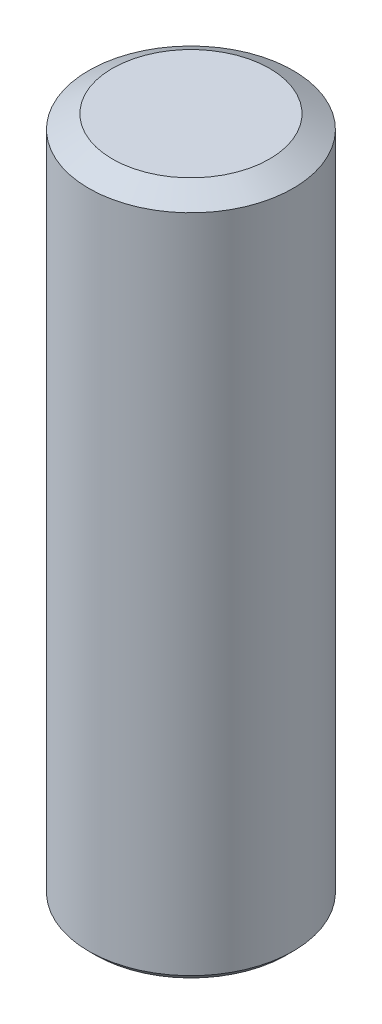
ISO-10303-21;
HEADER;
FILE_DESCRIPTION(('STEP AP214'),'2;1');
FILE_NAME('part.step','',(''),(''),'','','');
FILE_SCHEMA(('AUTOMOTIVE_DESIGN { 1 0 10303 214 1 1 1 1 }'));
ENDSEC;
DATA;
#1=APPLICATION_CONTEXT('core data for automotive mechanical design processes');
#2=APPLICATION_PROTOCOL_DEFINITION('international standard','automotive_design',2000,#1);
#3=PRODUCT_CONTEXT('',#1,'mechanical');
#4=PRODUCT('Part','Part','',(#3));
#5=PRODUCT_RELATED_PRODUCT_CATEGORY('part','',(#4));
#6=PRODUCT_DEFINITION_FORMATION('','',#4);
#7=PRODUCT_DEFINITION_CONTEXT('part definition',#1,'design');
#8=PRODUCT_DEFINITION('design','',#6,#7);
#9=PRODUCT_DEFINITION_SHAPE('','',#8);
#10=(LENGTH_UNIT() NAMED_UNIT(*) SI_UNIT(.MILLI.,.METRE.));
#11=(NAMED_UNIT(*) PLANE_ANGLE_UNIT() SI_UNIT($,.RADIAN.));
#12=(NAMED_UNIT(*) SI_UNIT($,.STERADIAN.) SOLID_ANGLE_UNIT());
#13=UNCERTAINTY_MEASURE_WITH_UNIT(LENGTH_MEASURE(1.E-05),#10,'distance_accuracy_value','');
#14=(GEOMETRIC_REPRESENTATION_CONTEXT(3) GLOBAL_UNCERTAINTY_ASSIGNED_CONTEXT((#13)) GLOBAL_UNIT_ASSIGNED_CONTEXT((#10,
#11,#12)) REPRESENTATION_CONTEXT('',''));
#15=CARTESIAN_POINT('',(0.,0.,0.));
#16=DIRECTION('',(0.,0.,1.));
#17=DIRECTION('',(1.,0.,0.));
#18=AXIS2_PLACEMENT_3D('',#15,#16,#17);
#19=CARTESIAN_POINT('',(0.,10.,0.));
#20=DIRECTION('',(0.,-1.,0.));
#21=DIRECTION('',(0.,0.,-1.));
#22=AXIS2_PLACEMENT_3D('',#19,#20,#21);
#23=CYLINDRICAL_SURFACE('',#22,1.5);
#24=CARTESIAN_POINT('',(0.,9.8,0.));
#25=DIRECTION('',(0.,1.,0.));
#26=DIRECTION('',(0.,0.,1.));
#27=AXIS2_PLACEMENT_3D('',#24,#25,#26);
#28=CIRCLE('',#27,1.5);
#29=CARTESIAN_POINT('',(0.,9.8,1.5));
#30=VERTEX_POINT('',#29);
#31=EDGE_CURVE('E11',#30,#30,#28,.F.);
#32=ORIENTED_EDGE('',*,*,#31,.T.);
#33=EDGE_LOOP('',(#32));
#34=FACE_BOUND('',#33,.T.);
#35=CARTESIAN_POINT('',(0.,0.100000000000001,0.));
#36=DIRECTION('',(0.,1.,0.));
#37=DIRECTION('',(0.,0.,1.));
#38=AXIS2_PLACEMENT_3D('',#35,#36,#37);
#39=CIRCLE('',#38,1.5);
#40=CARTESIAN_POINT('',(0.,0.100000000000001,1.5));
#41=VERTEX_POINT('',#40);
#42=EDGE_CURVE('E136',#41,#41,#39,.T.);
#43=ORIENTED_EDGE('',*,*,#42,.T.);
#44=EDGE_LOOP('',(#43));
#45=FACE_BOUND('',#44,.T.);
#46=ADVANCED_FACE('F34',(#34,#45),#23,.T.);
#47=CARTESIAN_POINT('',(0.,10.,0.));
#48=DIRECTION('',(0.,1.,0.));
#49=DIRECTION('',(0.,0.,1.));
#50=AXIS2_PLACEMENT_3D('',#47,#48,#49);
#51=PLANE('',#50);
#52=CARTESIAN_POINT('',(0.,10.,0.));
#53=DIRECTION('',(0.,1.,0.));
#54=DIRECTION('',(0.,0.,1.));
#55=AXIS2_PLACEMENT_3D('',#52,#53,#54);
#56=CIRCLE('',#55,1.15358983848622);
#57=CARTESIAN_POINT('',(0.,10.,1.15358983848622));
#58=VERTEX_POINT('',#57);
#59=EDGE_CURVE('E42',#58,#58,#56,.T.);
#60=ORIENTED_EDGE('',*,*,#59,.T.);
#61=EDGE_LOOP('',(#60));
#62=FACE_BOUND('',#61,.T.);
#63=ADVANCED_FACE('F149',(#62),#51,.T.);
#64=CARTESIAN_POINT('',(0.,0.,0.));
#65=DIRECTION('',(0.,1.,0.));
#66=DIRECTION('',(0.,0.,1.));
#67=AXIS2_PLACEMENT_3D('',#64,#65,#66);
#68=PLANE('',#67);
#69=CARTESIAN_POINT('',(0.,0.,0.));
#70=DIRECTION('',(0.,1.,0.));
#71=DIRECTION('',(0.,0.,1.));
#72=AXIS2_PLACEMENT_3D('',#69,#70,#71);
#73=CIRCLE('',#72,1.4);
#74=CARTESIAN_POINT('',(0.,0.,1.4));
#75=VERTEX_POINT('',#74);
#76=EDGE_CURVE('E144',#75,#75,#73,.F.);
#77=ORIENTED_EDGE('',*,*,#76,.T.);
#78=EDGE_LOOP('',(#77));
#79=FACE_BOUND('',#78,.T.);
#80=DIRECTION('',(-1.,0.,0.));
#81=VECTOR('',#80,1.);
#82=CARTESIAN_POINT('',(0.433012701892219,0.,0.75));
#83=LINE('',#82,#81);
#84=CARTESIAN_POINT('',(0.433012701892219,0.,0.75));
#85=VERTEX_POINT('',#84);
#86=CARTESIAN_POINT('',(-0.433012701892219,0.,0.75));
#87=VERTEX_POINT('',#86);
#88=EDGE_CURVE('E123',#85,#87,#83,.T.);
#89=ORIENTED_EDGE('',*,*,#88,.F.);
#90=DIRECTION('',(-0.5,0.,0.866025403784438));
#91=VECTOR('',#90,1.);
#92=CARTESIAN_POINT('',(0.866025403784439,0.,0.));
#93=LINE('',#92,#91);
#94=CARTESIAN_POINT('',(0.866025403784439,0.,0.));
#95=VERTEX_POINT('',#94);
#96=EDGE_CURVE('E49',#95,#85,#93,.T.);
#97=ORIENTED_EDGE('',*,*,#96,.F.);
#98=DIRECTION('',(0.5,0.,0.866025403784439));
#99=VECTOR('',#98,1.);
#100=CARTESIAN_POINT('',(0.43301270189222,0.,-0.75));
#101=LINE('',#100,#99);
#102=CARTESIAN_POINT('',(0.43301270189222,0.,-0.75));
#103=VERTEX_POINT('',#102);
#104=EDGE_CURVE('E132',#103,#95,#101,.T.);
#105=ORIENTED_EDGE('',*,*,#104,.F.);
#106=DIRECTION('',(1.,0.,0.));
#107=VECTOR('',#106,1.);
#108=CARTESIAN_POINT('',(-0.433012701892219,0.,-0.75));
#109=LINE('',#108,#107);
#110=CARTESIAN_POINT('',(-0.433012701892219,0.,-0.75));
#111=VERTEX_POINT('',#110);
#112=EDGE_CURVE('E130',#111,#103,#109,.T.);
#113=ORIENTED_EDGE('',*,*,#112,.F.);
#114=DIRECTION('',(0.5,0.,-0.866025403784438));
#115=VECTOR('',#114,1.);
#116=CARTESIAN_POINT('',(-0.866025403784438,0.,0.));
#117=LINE('',#116,#115);
#118=CARTESIAN_POINT('',(-0.866025403784438,0.,0.));
#119=VERTEX_POINT('',#118);
#120=EDGE_CURVE('E97',#119,#111,#117,.T.);
#121=ORIENTED_EDGE('',*,*,#120,.F.);
#122=DIRECTION('',(-0.5,0.,-0.866025403784439));
#123=VECTOR('',#122,1.);
#124=CARTESIAN_POINT('',(-0.433012701892219,0.,0.75));
#125=LINE('',#124,#123);
#126=EDGE_CURVE('E126',#87,#119,#125,.T.);
#127=ORIENTED_EDGE('',*,*,#126,.F.);
#128=EDGE_LOOP('',(#89,#97,#105,#113,#121,#127));
#129=FACE_BOUND('',#128,.T.);
#130=ADVANCED_FACE('F165',(#79,#129),#68,.F.);
#131=CARTESIAN_POINT('',(0.866025403784439,2.,0.));
#132=DIRECTION('',(0.866025403784438,0.,0.5));
#133=DIRECTION('',(0.5,0.,-0.866025403784438));
#134=AXIS2_PLACEMENT_3D('',#131,#132,#133);
#135=PLANE('',#134);
#136=ORIENTED_EDGE('',*,*,#96,.T.);
#137=DIRECTION('',(0.,-1.,0.));
#138=VECTOR('',#137,1.);
#139=CARTESIAN_POINT('',(0.433012701892219,2.,0.75));
#140=LINE('',#139,#138);
#141=CARTESIAN_POINT('',(0.433012701892219,2.,0.75));
#142=VERTEX_POINT('',#141);
#143=EDGE_CURVE('E79',#142,#85,#140,.T.);
#144=ORIENTED_EDGE('',*,*,#143,.F.);
#145=DIRECTION('',(-0.5,0.,0.866025403784438));
#146=VECTOR('',#145,1.);
#147=CARTESIAN_POINT('',(0.866025403784439,2.,0.));
#148=LINE('',#147,#146);
#149=CARTESIAN_POINT('',(0.866025403784439,2.,0.));
#150=VERTEX_POINT('',#149);
#151=EDGE_CURVE('E134',#150,#142,#148,.T.);
#152=ORIENTED_EDGE('',*,*,#151,.F.);
#153=DIRECTION('',(0.,-1.,0.));
#154=VECTOR('',#153,1.);
#155=CARTESIAN_POINT('',(0.866025403784439,2.,0.));
#156=LINE('',#155,#154);
#157=EDGE_CURVE('E57',#150,#95,#156,.T.);
#158=ORIENTED_EDGE('',*,*,#157,.T.);
#159=EDGE_LOOP('',(#136,#144,#152,#158));
#160=FACE_BOUND('',#159,.T.);
#161=ADVANCED_FACE('F170',(#160),#135,.F.);
#162=CARTESIAN_POINT('',(0.43301270189222,2.,-0.75));
#163=DIRECTION('',(0.866025403784439,0.,-0.5));
#164=DIRECTION('',(-0.5,0.,-0.866025403784439));
#165=AXIS2_PLACEMENT_3D('',#162,#163,#164);
#166=PLANE('',#165);
#167=ORIENTED_EDGE('',*,*,#104,.T.);
#168=ORIENTED_EDGE('',*,*,#157,.F.);
#169=DIRECTION('',(0.5,0.,0.866025403784439));
#170=VECTOR('',#169,1.);
#171=CARTESIAN_POINT('',(0.43301270189222,2.,-0.75));
#172=LINE('',#171,#170);
#173=CARTESIAN_POINT('',(0.43301270189222,2.,-0.75));
#174=VERTEX_POINT('',#173);
#175=EDGE_CURVE('E109',#174,#150,#172,.T.);
#176=ORIENTED_EDGE('',*,*,#175,.F.);
#177=DIRECTION('',(0.,-1.,0.));
#178=VECTOR('',#177,1.);
#179=CARTESIAN_POINT('',(0.43301270189222,2.,-0.75));
#180=LINE('',#179,#178);
#181=EDGE_CURVE('E101',#174,#103,#180,.T.);
#182=ORIENTED_EDGE('',*,*,#181,.T.);
#183=EDGE_LOOP('',(#167,#168,#176,#182));
#184=FACE_BOUND('',#183,.T.);
#185=ADVANCED_FACE('F175',(#184),#166,.F.);
#186=CARTESIAN_POINT('',(-0.433012701892219,2.,-0.75));
#187=DIRECTION('',(0.,0.,-1.));
#188=DIRECTION('',(-1.,0.,0.));
#189=AXIS2_PLACEMENT_3D('',#186,#187,#188);
#190=PLANE('',#189);
#191=ORIENTED_EDGE('',*,*,#112,.T.);
#192=ORIENTED_EDGE('',*,*,#181,.F.);
#193=DIRECTION('',(1.,0.,0.));
#194=VECTOR('',#193,1.);
#195=CARTESIAN_POINT('',(-0.433012701892219,2.,-0.75));
#196=LINE('',#195,#194);
#197=CARTESIAN_POINT('',(-0.433012701892219,2.,-0.75));
#198=VERTEX_POINT('',#197);
#199=EDGE_CURVE('E105',#198,#174,#196,.T.);
#200=ORIENTED_EDGE('',*,*,#199,.F.);
#201=DIRECTION('',(0.,-1.,0.));
#202=VECTOR('',#201,1.);
#203=CARTESIAN_POINT('',(-0.433012701892219,2.,-0.75));
#204=LINE('',#203,#202);
#205=EDGE_CURVE('E90',#198,#111,#204,.T.);
#206=ORIENTED_EDGE('',*,*,#205,.T.);
#207=EDGE_LOOP('',(#191,#192,#200,#206));
#208=FACE_BOUND('',#207,.T.);
#209=ADVANCED_FACE('F106',(#208),#190,.F.);
#210=CARTESIAN_POINT('',(-0.866025403784438,2.,0.));
#211=DIRECTION('',(-0.866025403784439,0.,-0.5));
#212=DIRECTION('',(-0.5,0.,0.866025403784438));
#213=AXIS2_PLACEMENT_3D('',#210,#211,#212);
#214=PLANE('',#213);
#215=ORIENTED_EDGE('',*,*,#120,.T.);
#216=ORIENTED_EDGE('',*,*,#205,.F.);
#217=DIRECTION('',(0.5,0.,-0.866025403784438));
#218=VECTOR('',#217,1.);
#219=CARTESIAN_POINT('',(-0.866025403784438,2.,0.));
#220=LINE('',#219,#218);
#221=CARTESIAN_POINT('',(-0.866025403784438,2.,0.));
#222=VERTEX_POINT('',#221);
#223=EDGE_CURVE('E94',#222,#198,#220,.T.);
#224=ORIENTED_EDGE('',*,*,#223,.F.);
#225=DIRECTION('',(0.,-1.,0.));
#226=VECTOR('',#225,1.);
#227=CARTESIAN_POINT('',(-0.866025403784438,2.,0.));
#228=LINE('',#227,#226);
#229=EDGE_CURVE('E102',#222,#119,#228,.T.);
#230=ORIENTED_EDGE('',*,*,#229,.T.);
#231=EDGE_LOOP('',(#215,#216,#224,#230));
#232=FACE_BOUND('',#231,.T.);
#233=ADVANCED_FACE('F92',(#232),#214,.F.);
#234=CARTESIAN_POINT('',(-0.433012701892219,2.,0.75));
#235=DIRECTION('',(-0.866025403784439,0.,0.5));
#236=DIRECTION('',(0.5,0.,0.866025403784439));
#237=AXIS2_PLACEMENT_3D('',#234,#235,#236);
#238=PLANE('',#237);
#239=ORIENTED_EDGE('',*,*,#126,.T.);
#240=ORIENTED_EDGE('',*,*,#229,.F.);
#241=DIRECTION('',(-0.5,0.,-0.866025403784439));
#242=VECTOR('',#241,1.);
#243=CARTESIAN_POINT('',(-0.433012701892219,2.,0.75));
#244=LINE('',#243,#242);
#245=CARTESIAN_POINT('',(-0.433012701892219,2.,0.75));
#246=VERTEX_POINT('',#245);
#247=EDGE_CURVE('E115',#246,#222,#244,.T.);
#248=ORIENTED_EDGE('',*,*,#247,.F.);
#249=DIRECTION('',(0.,-1.,0.));
#250=VECTOR('',#249,1.);
#251=CARTESIAN_POINT('',(-0.433012701892219,2.,0.75));
#252=LINE('',#251,#250);
#253=EDGE_CURVE('E139',#246,#87,#252,.T.);
#254=ORIENTED_EDGE('',*,*,#253,.T.);
#255=EDGE_LOOP('',(#239,#240,#248,#254));
#256=FACE_BOUND('',#255,.T.);
#257=ADVANCED_FACE('F179',(#256),#238,.F.);
#258=CARTESIAN_POINT('',(0.433012701892219,2.,0.75));
#259=DIRECTION('',(0.,0.,1.));
#260=DIRECTION('',(1.,0.,0.));
#261=AXIS2_PLACEMENT_3D('',#258,#259,#260);
#262=PLANE('',#261);
#263=ORIENTED_EDGE('',*,*,#88,.T.);
#264=ORIENTED_EDGE('',*,*,#253,.F.);
#265=DIRECTION('',(-1.,0.,0.));
#266=VECTOR('',#265,1.);
#267=CARTESIAN_POINT('',(0.433012701892219,2.,0.75));
#268=LINE('',#267,#266);
#269=EDGE_CURVE('E117',#142,#246,#268,.T.);
#270=ORIENTED_EDGE('',*,*,#269,.F.);
#271=ORIENTED_EDGE('',*,*,#143,.T.);
#272=EDGE_LOOP('',(#263,#264,#270,#271));
#273=FACE_BOUND('',#272,.T.);
#274=ADVANCED_FACE('F176',(#273),#262,.F.);
#275=CARTESIAN_POINT('',(0.,2.,0.));
#276=DIRECTION('',(0.,-1.,0.));
#277=DIRECTION('',(0.,0.,-1.));
#278=AXIS2_PLACEMENT_3D('',#275,#276,#277);
#279=PLANE('',#278);
#280=ORIENTED_EDGE('',*,*,#151,.T.);
#281=ORIENTED_EDGE('',*,*,#269,.T.);
#282=ORIENTED_EDGE('',*,*,#247,.T.);
#283=ORIENTED_EDGE('',*,*,#223,.T.);
#284=ORIENTED_EDGE('',*,*,#199,.T.);
#285=ORIENTED_EDGE('',*,*,#175,.T.);
#286=EDGE_LOOP('',(#280,#281,#282,#283,#284,#285));
#287=FACE_BOUND('',#286,.T.);
#288=ADVANCED_FACE('F112',(#287),#279,.T.);
#289=CARTESIAN_POINT('',(0.,0.100000000000001,0.));
#290=DIRECTION('',(0.,1.,0.));
#291=DIRECTION('',(0.,0.,1.));
#292=AXIS2_PLACEMENT_3D('',#289,#290,#291);
#293=CONICAL_SURFACE('',#292,1.5,0.785398163397453);
#294=ORIENTED_EDGE('',*,*,#76,.F.);
#295=EDGE_LOOP('',(#294));
#296=FACE_BOUND('',#295,.T.);
#297=ORIENTED_EDGE('',*,*,#42,.F.);
#298=EDGE_LOOP('',(#297));
#299=FACE_BOUND('',#298,.T.);
#300=ADVANCED_FACE('F152',(#296,#299),#293,.T.);
#301=CARTESIAN_POINT('',(0.,10.,0.));
#302=DIRECTION('',(0.,-1.,0.));
#303=DIRECTION('',(0.,0.,-1.));
#304=AXIS2_PLACEMENT_3D('',#301,#302,#303);
#305=CONICAL_SURFACE('',#304,1.15358983848622,1.0471975511966);
#306=ORIENTED_EDGE('',*,*,#31,.F.);
#307=EDGE_LOOP('',(#306));
#308=FACE_BOUND('',#307,.T.);
#309=ORIENTED_EDGE('',*,*,#59,.F.);
#310=EDGE_LOOP('',(#309));
#311=FACE_BOUND('',#310,.T.);
#312=ADVANCED_FACE('F36',(#308,#311),#305,.T.);
#313=CLOSED_SHELL('',(#46,#63,#130,#161,#185,#209,#233,#257,#274,#288,#300,#312));
#314=MANIFOLD_SOLID_BREP('B2',#313);
#315=ADVANCED_BREP_SHAPE_REPRESENTATION('',(#18,#314),#14);
#316=SHAPE_DEFINITION_REPRESENTATION(#9,#315);
ENDSEC;
END-ISO-10303-21;
